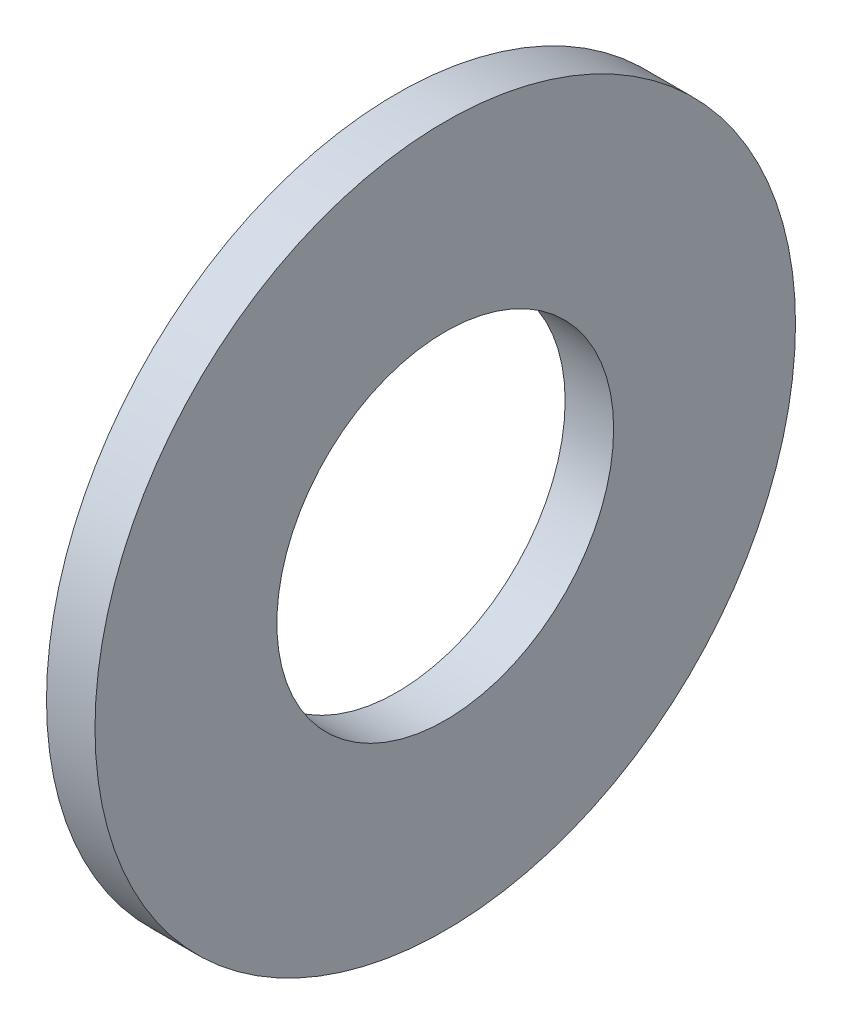
ISO-10303-21;
HEADER;
FILE_DESCRIPTION(('STEP AP214'),'2;1');
FILE_NAME('part.step','',(''),(''),'','','');
FILE_SCHEMA(('AUTOMOTIVE_DESIGN { 1 0 10303 214 1 1 1 1 }'));
ENDSEC;
DATA;
#1=APPLICATION_CONTEXT('core data for automotive mechanical design processes');
#2=APPLICATION_PROTOCOL_DEFINITION('international standard','automotive_design',2000,#1);
#3=PRODUCT_CONTEXT('',#1,'mechanical');
#4=PRODUCT('Part','Part','',(#3));
#5=PRODUCT_RELATED_PRODUCT_CATEGORY('part','',(#4));
#6=PRODUCT_DEFINITION_FORMATION('','',#4);
#7=PRODUCT_DEFINITION_CONTEXT('part definition',#1,'design');
#8=PRODUCT_DEFINITION('design','',#6,#7);
#9=PRODUCT_DEFINITION_SHAPE('','',#8);
#10=(LENGTH_UNIT() NAMED_UNIT(*) SI_UNIT(.MILLI.,.METRE.));
#11=(NAMED_UNIT(*) PLANE_ANGLE_UNIT() SI_UNIT($,.RADIAN.));
#12=(NAMED_UNIT(*) SI_UNIT($,.STERADIAN.) SOLID_ANGLE_UNIT());
#13=UNCERTAINTY_MEASURE_WITH_UNIT(LENGTH_MEASURE(1.E-05),#10,'distance_accuracy_value','');
#14=(GEOMETRIC_REPRESENTATION_CONTEXT(3) GLOBAL_UNCERTAINTY_ASSIGNED_CONTEXT((#13)) GLOBAL_UNIT_ASSIGNED_CONTEXT((#10,
#11,#12)) REPRESENTATION_CONTEXT('',''));
#15=CARTESIAN_POINT('',(0.,0.,0.));
#16=DIRECTION('',(0.,0.,1.));
#17=DIRECTION('',(1.,0.,0.));
#18=AXIS2_PLACEMENT_3D('',#15,#16,#17);
#19=CARTESIAN_POINT('',(3.6,0.,0.));
#20=DIRECTION('',(1.,0.,0.));
#21=DIRECTION('',(0.,0.,-1.));
#22=AXIS2_PLACEMENT_3D('',#19,#20,#21);
#23=PLANE('',#22);
#24=CARTESIAN_POINT('',(3.6,0.,0.));
#25=DIRECTION('',(1.,0.,0.));
#26=DIRECTION('',(0.,0.,-1.));
#27=AXIS2_PLACEMENT_3D('',#24,#25,#26);
#28=CIRCLE('',#27,26.);
#29=CARTESIAN_POINT('',(3.6,0.,-26.));
#30=VERTEX_POINT('',#29);
#31=EDGE_CURVE('E10',#30,#30,#28,.T.);
#32=ORIENTED_EDGE('',*,*,#31,.T.);
#33=EDGE_LOOP('',(#32));
#34=FACE_BOUND('',#33,.T.);
#35=CARTESIAN_POINT('',(3.6,0.,0.));
#36=DIRECTION('',(1.,0.,0.));
#37=DIRECTION('',(0.,0.,-1.));
#38=AXIS2_PLACEMENT_3D('',#35,#36,#37);
#39=CIRCLE('',#38,12.5);
#40=CARTESIAN_POINT('',(3.6,0.,-12.5));
#41=VERTEX_POINT('',#40);
#42=EDGE_CURVE('E56',#41,#41,#39,.T.);
#43=ORIENTED_EDGE('',*,*,#42,.F.);
#44=EDGE_LOOP('',(#43));
#45=FACE_BOUND('',#44,.T.);
#46=ADVANCED_FACE('F43',(#34,#45),#23,.T.);
#47=CARTESIAN_POINT('',(0.,0.,0.));
#48=DIRECTION('',(1.,0.,0.));
#49=DIRECTION('',(0.,0.,-1.));
#50=AXIS2_PLACEMENT_3D('',#47,#48,#49);
#51=PLANE('',#50);
#52=CARTESIAN_POINT('',(0.,0.,0.));
#53=DIRECTION('',(1.,0.,0.));
#54=DIRECTION('',(0.,0.,-1.));
#55=AXIS2_PLACEMENT_3D('',#52,#53,#54);
#56=CIRCLE('',#55,26.);
#57=CARTESIAN_POINT('',(0.,0.,-26.));
#58=VERTEX_POINT('',#57);
#59=EDGE_CURVE('E47',#58,#58,#56,.T.);
#60=ORIENTED_EDGE('',*,*,#59,.F.);
#61=EDGE_LOOP('',(#60));
#62=FACE_BOUND('',#61,.T.);
#63=CARTESIAN_POINT('',(0.,0.,0.));
#64=DIRECTION('',(1.,0.,0.));
#65=DIRECTION('',(0.,0.,-1.));
#66=AXIS2_PLACEMENT_3D('',#63,#64,#65);
#67=CIRCLE('',#66,12.5);
#68=CARTESIAN_POINT('',(0.,0.,-12.5));
#69=VERTEX_POINT('',#68);
#70=EDGE_CURVE('E58',#69,#69,#67,.T.);
#71=ORIENTED_EDGE('',*,*,#70,.T.);
#72=EDGE_LOOP('',(#71));
#73=FACE_BOUND('',#72,.T.);
#74=ADVANCED_FACE('F70',(#62,#73),#51,.F.);
#75=CARTESIAN_POINT('',(3.6,0.,0.));
#76=DIRECTION('',(-1.,0.,0.));
#77=DIRECTION('',(0.,0.,1.));
#78=AXIS2_PLACEMENT_3D('',#75,#76,#77);
#79=CYLINDRICAL_SURFACE('',#78,26.);
#80=ORIENTED_EDGE('',*,*,#31,.F.);
#81=EDGE_LOOP('',(#80));
#82=FACE_BOUND('',#81,.T.);
#83=ORIENTED_EDGE('',*,*,#59,.T.);
#84=EDGE_LOOP('',(#83));
#85=FACE_BOUND('',#84,.T.);
#86=ADVANCED_FACE('F45',(#82,#85),#79,.T.);
#87=CARTESIAN_POINT('',(3.6,0.,0.));
#88=DIRECTION('',(-1.,0.,0.));
#89=DIRECTION('',(0.,0.,1.));
#90=AXIS2_PLACEMENT_3D('',#87,#88,#89);
#91=CYLINDRICAL_SURFACE('',#90,12.5);
#92=ORIENTED_EDGE('',*,*,#42,.T.);
#93=EDGE_LOOP('',(#92));
#94=FACE_BOUND('',#93,.T.);
#95=ORIENTED_EDGE('',*,*,#70,.F.);
#96=EDGE_LOOP('',(#95));
#97=FACE_BOUND('',#96,.T.);
#98=ADVANCED_FACE('F66',(#94,#97),#91,.F.);
#99=CLOSED_SHELL('',(#46,#74,#86,#98));
#100=MANIFOLD_SOLID_BREP('B2',#99);
#101=ADVANCED_BREP_SHAPE_REPRESENTATION('',(#18,#100),#14);
#102=SHAPE_DEFINITION_REPRESENTATION(#9,#101);
ENDSEC;
END-ISO-10303-21;
